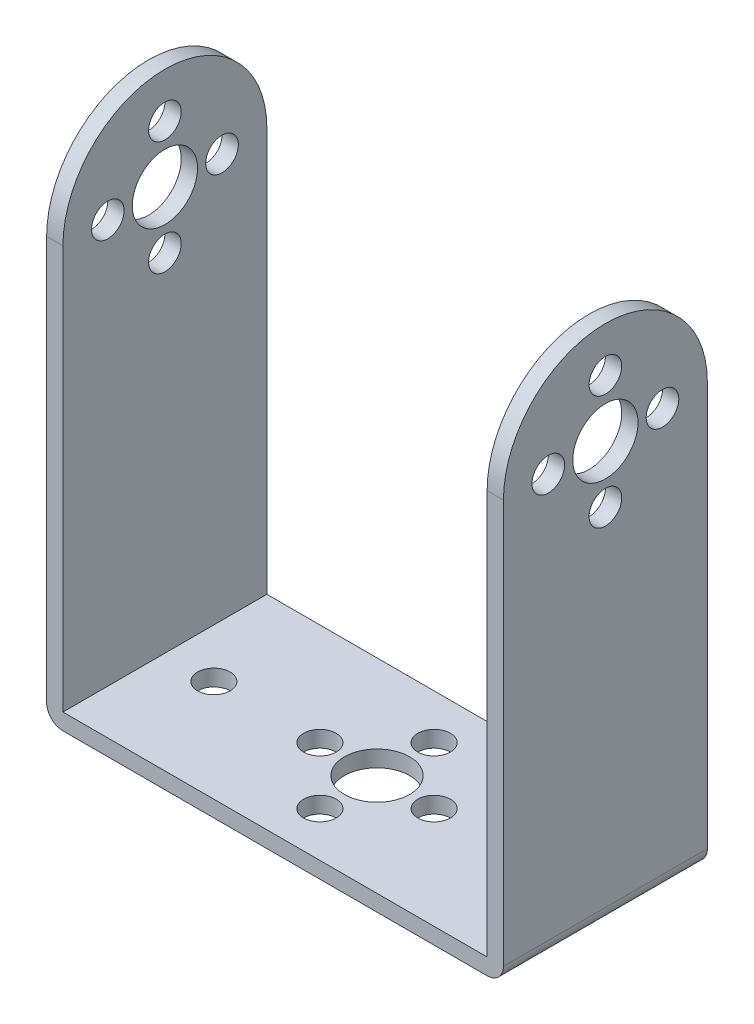
ISO-10303-21;
HEADER;
FILE_DESCRIPTION(('STEP AP214'),'2;1');
FILE_NAME('part.step','',(''),(''),'','','');
FILE_SCHEMA(('AUTOMOTIVE_DESIGN { 1 0 10303 214 1 1 1 1 }'));
ENDSEC;
DATA;
#1=APPLICATION_CONTEXT('core data for automotive mechanical design processes');
#2=APPLICATION_PROTOCOL_DEFINITION('international standard','automotive_design',2000,#1);
#3=PRODUCT_CONTEXT('',#1,'mechanical');
#4=PRODUCT('Part','Part','',(#3));
#5=PRODUCT_RELATED_PRODUCT_CATEGORY('part','',(#4));
#6=PRODUCT_DEFINITION_FORMATION('','',#4);
#7=PRODUCT_DEFINITION_CONTEXT('part definition',#1,'design');
#8=PRODUCT_DEFINITION('design','',#6,#7);
#9=PRODUCT_DEFINITION_SHAPE('','',#8);
#10=(LENGTH_UNIT() NAMED_UNIT(*) SI_UNIT(.MILLI.,.METRE.));
#11=(NAMED_UNIT(*) PLANE_ANGLE_UNIT() SI_UNIT($,.RADIAN.));
#12=(NAMED_UNIT(*) SI_UNIT($,.STERADIAN.) SOLID_ANGLE_UNIT());
#13=UNCERTAINTY_MEASURE_WITH_UNIT(LENGTH_MEASURE(1.E-05),#10,'distance_accuracy_value','');
#14=(GEOMETRIC_REPRESENTATION_CONTEXT(3) GLOBAL_UNCERTAINTY_ASSIGNED_CONTEXT((#13)) GLOBAL_UNIT_ASSIGNED_CONTEXT((#10,
#11,#12)) REPRESENTATION_CONTEXT('',''));
#15=CARTESIAN_POINT('',(0.,0.,0.));
#16=DIRECTION('',(0.,0.,1.));
#17=DIRECTION('',(1.,0.,0.));
#18=AXIS2_PLACEMENT_3D('',#15,#16,#17);
#19=CARTESIAN_POINT('',(2.,-23.75,10.7495807989479));
#20=DIRECTION('',(0.,0.,1.));
#21=DIRECTION('',(1.,0.,0.));
#22=AXIS2_PLACEMENT_3D('',#19,#20,#21);
#23=CYLINDRICAL_SURFACE('',#22,2.);
#24=DIRECTION('',(0.,0.,1.));
#25=VECTOR('',#24,1.);
#26=CARTESIAN_POINT('',(0.,-23.75,10.7495807989479));
#27=LINE('',#26,#25);
#28=CARTESIAN_POINT('',(0.,-23.75,-1.75041920105211));
#29=VERTEX_POINT('',#28);
#30=CARTESIAN_POINT('',(0.,-23.75,23.2495807989479));
#31=VERTEX_POINT('',#30);
#32=EDGE_CURVE('E169',#29,#31,#27,.T.);
#33=ORIENTED_EDGE('',*,*,#32,.F.);
#34=CARTESIAN_POINT('',(2.,-23.75,-1.75041920105211));
#35=DIRECTION('',(0.,0.,1.));
#36=DIRECTION('',(1.,0.,0.));
#37=AXIS2_PLACEMENT_3D('',#34,#35,#36);
#38=CIRCLE('',#37,2.);
#39=CARTESIAN_POINT('',(1.99999999999999,-25.75,-1.75041920105211));
#40=VERTEX_POINT('',#39);
#41=EDGE_CURVE('E46',#40,#29,#38,.F.);
#42=ORIENTED_EDGE('',*,*,#41,.F.);
#43=DIRECTION('',(0.,0.,1.));
#44=VECTOR('',#43,1.);
#45=CARTESIAN_POINT('',(2.,-25.75,23.2495807989479));
#46=LINE('',#45,#44);
#47=CARTESIAN_POINT('',(1.99999999999999,-25.75,23.2495807989479));
#48=VERTEX_POINT('',#47);
#49=EDGE_CURVE('E173',#48,#40,#46,.F.);
#50=ORIENTED_EDGE('',*,*,#49,.F.);
#51=CARTESIAN_POINT('',(2.,-23.75,23.2495807989479));
#52=DIRECTION('',(0.,0.,-1.));
#53=DIRECTION('',(0.,1.,0.));
#54=AXIS2_PLACEMENT_3D('',#51,#52,#53);
#55=CIRCLE('',#54,2.);
#56=EDGE_CURVE('E11',#31,#48,#55,.F.);
#57=ORIENTED_EDGE('',*,*,#56,.F.);
#58=EDGE_LOOP('',(#33,#42,#50,#57));
#59=FACE_BOUND('',#58,.T.);
#60=ADVANCED_FACE('F38',(#59),#23,.T.);
#61=CARTESIAN_POINT('',(54.,-23.75,10.7495807989479));
#62=DIRECTION('',(0.,0.,1.));
#63=DIRECTION('',(1.,0.,0.));
#64=AXIS2_PLACEMENT_3D('',#61,#62,#63);
#65=CYLINDRICAL_SURFACE('',#64,2.);
#66=DIRECTION('',(0.,0.,-1.));
#67=VECTOR('',#66,1.);
#68=CARTESIAN_POINT('',(56.,-23.75,10.7495807989479));
#69=LINE('',#68,#67);
#70=CARTESIAN_POINT('',(56.,-23.75,23.2495807989479));
#71=VERTEX_POINT('',#70);
#72=CARTESIAN_POINT('',(56.,-23.75,-1.75041920105211));
#73=VERTEX_POINT('',#72);
#74=EDGE_CURVE('E155',#71,#73,#69,.T.);
#75=ORIENTED_EDGE('',*,*,#74,.F.);
#76=CARTESIAN_POINT('',(54.,-23.75,23.2495807989479));
#77=DIRECTION('',(0.,0.,-1.));
#78=DIRECTION('',(0.,1.,0.));
#79=AXIS2_PLACEMENT_3D('',#76,#77,#78);
#80=CIRCLE('',#79,2.);
#81=CARTESIAN_POINT('',(54.,-25.75,23.2495807989479));
#82=VERTEX_POINT('',#81);
#83=EDGE_CURVE('E163',#82,#71,#80,.F.);
#84=ORIENTED_EDGE('',*,*,#83,.F.);
#85=DIRECTION('',(0.,0.,-1.));
#86=VECTOR('',#85,1.);
#87=CARTESIAN_POINT('',(54.,-25.75,10.7495807989479));
#88=LINE('',#87,#86);
#89=CARTESIAN_POINT('',(54.,-25.75,-1.75041920105211));
#90=VERTEX_POINT('',#89);
#91=EDGE_CURVE('E159',#90,#82,#88,.F.);
#92=ORIENTED_EDGE('',*,*,#91,.F.);
#93=CARTESIAN_POINT('',(54.,-23.75,-1.75041920105211));
#94=DIRECTION('',(0.,0.,1.));
#95=DIRECTION('',(1.,0.,0.));
#96=AXIS2_PLACEMENT_3D('',#93,#94,#95);
#97=CIRCLE('',#96,2.);
#98=EDGE_CURVE('E166',#73,#90,#97,.F.);
#99=ORIENTED_EDGE('',*,*,#98,.F.);
#100=EDGE_LOOP('',(#75,#84,#92,#99));
#101=FACE_BOUND('',#100,.T.);
#102=ADVANCED_FACE('F405',(#101),#65,.T.);
#103=CARTESIAN_POINT('',(56.,25.7500009851858,10.7495807989479));
#104=DIRECTION('',(-1.,0.,0.));
#105=DIRECTION('',(0.,0.,1.));
#106=AXIS2_PLACEMENT_3D('',#103,#104,#105);
#107=CYLINDRICAL_SURFACE('',#106,12.5);
#108=DIRECTION('',(-1.,0.,0.));
#109=VECTOR('',#108,1.);
#110=CARTESIAN_POINT('',(56.,25.7500009851858,23.2495807989479));
#111=LINE('',#110,#109);
#112=CARTESIAN_POINT('',(1.99999999999999,25.7500009851858,23.2495807989479));
#113=VERTEX_POINT('',#112);
#114=CARTESIAN_POINT('',(0.,25.7500009851858,23.2495807989479));
#115=VERTEX_POINT('',#114);
#116=EDGE_CURVE('E144',#113,#115,#111,.T.);
#117=ORIENTED_EDGE('',*,*,#116,.F.);
#118=CARTESIAN_POINT('',(2.,25.7500009851858,10.7495807989479));
#119=DIRECTION('',(-1.,0.,0.));
#120=DIRECTION('',(0.,-1.,0.));
#121=AXIS2_PLACEMENT_3D('',#118,#119,#120);
#122=CIRCLE('',#121,12.5);
#123=CARTESIAN_POINT('',(1.99999999999999,25.75,-1.75041920105209));
#124=VERTEX_POINT('',#123);
#125=EDGE_CURVE('E136',#124,#113,#122,.F.);
#126=ORIENTED_EDGE('',*,*,#125,.F.);
#127=DIRECTION('',(-1.,0.,0.));
#128=VECTOR('',#127,1.);
#129=CARTESIAN_POINT('',(56.,25.75,-1.75041920105209));
#130=LINE('',#129,#128);
#131=CARTESIAN_POINT('',(0.,25.75,-1.75041920105209));
#132=VERTEX_POINT('',#131);
#133=EDGE_CURVE('E143',#124,#132,#130,.T.);
#134=ORIENTED_EDGE('',*,*,#133,.T.);
#135=CARTESIAN_POINT('',(0.,25.7500009851858,10.7495807989479));
#136=DIRECTION('',(1.,0.,0.));
#137=DIRECTION('',(0.,0.,-1.));
#138=AXIS2_PLACEMENT_3D('',#135,#136,#137);
#139=CIRCLE('',#138,12.5);
#140=EDGE_CURVE('E190',#132,#115,#139,.T.);
#141=ORIENTED_EDGE('',*,*,#140,.T.);
#142=EDGE_LOOP('',(#117,#126,#134,#141));
#143=FACE_BOUND('',#142,.T.);
#144=ADVANCED_FACE('F387',(#143),#107,.T.);
#145=CARTESIAN_POINT('',(56.,25.7500009851858,10.7495807989479));
#146=DIRECTION('',(-1.,0.,0.));
#147=DIRECTION('',(0.,0.,1.));
#148=AXIS2_PLACEMENT_3D('',#145,#146,#147);
#149=CYLINDRICAL_SURFACE('',#148,4.);
#150=CARTESIAN_POINT('',(2.,25.7500009851858,10.7495807989479));
#151=DIRECTION('',(-1.,0.,0.));
#152=DIRECTION('',(0.,-1.,0.));
#153=AXIS2_PLACEMENT_3D('',#150,#151,#152);
#154=CIRCLE('',#153,4.);
#155=CARTESIAN_POINT('',(2.,21.7500009851858,10.7495807989479));
#156=VERTEX_POINT('',#155);
#157=EDGE_CURVE('E254',#156,#156,#154,.F.);
#158=ORIENTED_EDGE('',*,*,#157,.T.);
#159=EDGE_LOOP('',(#158));
#160=FACE_BOUND('',#159,.T.);
#161=CARTESIAN_POINT('',(0.,25.7500009851858,10.7495807989479));
#162=DIRECTION('',(1.,0.,0.));
#163=DIRECTION('',(0.,0.,-1.));
#164=AXIS2_PLACEMENT_3D('',#161,#162,#163);
#165=CIRCLE('',#164,4.);
#166=CARTESIAN_POINT('',(0.,25.7500009851858,6.7495807989479));
#167=VERTEX_POINT('',#166);
#168=EDGE_CURVE('E199',#167,#167,#165,.T.);
#169=ORIENTED_EDGE('',*,*,#168,.F.);
#170=EDGE_LOOP('',(#169));
#171=FACE_BOUND('',#170,.T.);
#172=ADVANCED_FACE('F413',(#160,#171),#149,.F.);
#173=CARTESIAN_POINT('',(56.,32.7500009851858,10.7495807989479));
#174=DIRECTION('',(-1.,0.,0.));
#175=DIRECTION('',(0.,0.,1.));
#176=AXIS2_PLACEMENT_3D('',#173,#174,#175);
#177=CYLINDRICAL_SURFACE('',#176,2.);
#178=CARTESIAN_POINT('',(2.,32.7500009851858,10.7495807989479));
#179=DIRECTION('',(-1.,0.,0.));
#180=DIRECTION('',(0.,-1.,0.));
#181=AXIS2_PLACEMENT_3D('',#178,#179,#180);
#182=CIRCLE('',#181,2.);
#183=CARTESIAN_POINT('',(2.,30.7500009851858,10.7495807989479));
#184=VERTEX_POINT('',#183);
#185=EDGE_CURVE('E255',#184,#184,#182,.F.);
#186=ORIENTED_EDGE('',*,*,#185,.T.);
#187=EDGE_LOOP('',(#186));
#188=FACE_BOUND('',#187,.T.);
#189=CARTESIAN_POINT('',(0.,32.7500009851858,10.7495807989479));
#190=DIRECTION('',(1.,0.,0.));
#191=DIRECTION('',(0.,0.,-1.));
#192=AXIS2_PLACEMENT_3D('',#189,#190,#191);
#193=CIRCLE('',#192,2.);
#194=CARTESIAN_POINT('',(0.,32.7500009851858,8.74958079894788));
#195=VERTEX_POINT('',#194);
#196=EDGE_CURVE('E220',#195,#195,#193,.T.);
#197=ORIENTED_EDGE('',*,*,#196,.F.);
#198=EDGE_LOOP('',(#197));
#199=FACE_BOUND('',#198,.T.);
#200=ADVANCED_FACE('F441',(#188,#199),#177,.F.);
#201=CARTESIAN_POINT('',(56.,25.7500019703715,17.749579813762));
#202=DIRECTION('',(-1.,0.,0.));
#203=DIRECTION('',(0.,0.,1.));
#204=AXIS2_PLACEMENT_3D('',#201,#202,#203);
#205=CYLINDRICAL_SURFACE('',#204,2.);
#206=CARTESIAN_POINT('',(2.,25.7500019703715,17.749579813762));
#207=DIRECTION('',(-1.,0.,0.));
#208=DIRECTION('',(0.,-1.,0.));
#209=AXIS2_PLACEMENT_3D('',#206,#207,#208);
#210=CIRCLE('',#209,2.);
#211=CARTESIAN_POINT('',(2.,23.7500019703715,17.749579813762));
#212=VERTEX_POINT('',#211);
#213=EDGE_CURVE('E260',#212,#212,#210,.F.);
#214=ORIENTED_EDGE('',*,*,#213,.T.);
#215=EDGE_LOOP('',(#214));
#216=FACE_BOUND('',#215,.T.);
#217=CARTESIAN_POINT('',(0.,25.7500019703715,17.749579813762));
#218=DIRECTION('',(1.,0.,0.));
#219=DIRECTION('',(0.,0.,-1.));
#220=AXIS2_PLACEMENT_3D('',#217,#218,#219);
#221=CIRCLE('',#220,2.);
#222=CARTESIAN_POINT('',(0.,25.7500019703715,15.749579813762));
#223=VERTEX_POINT('',#222);
#224=EDGE_CURVE('E228',#223,#223,#221,.T.);
#225=ORIENTED_EDGE('',*,*,#224,.F.);
#226=EDGE_LOOP('',(#225));
#227=FACE_BOUND('',#226,.T.);
#228=ADVANCED_FACE('F445',(#216,#227),#205,.F.);
#229=CARTESIAN_POINT('',(56.,18.7500029555574,10.7495807989477));
#230=DIRECTION('',(-1.,0.,0.));
#231=DIRECTION('',(0.,0.,1.));
#232=AXIS2_PLACEMENT_3D('',#229,#230,#231);
#233=CYLINDRICAL_SURFACE('',#232,2.);
#234=CARTESIAN_POINT('',(2.,18.7500029555574,10.7495807989477));
#235=DIRECTION('',(-1.,0.,0.));
#236=DIRECTION('',(0.,-1.,0.));
#237=AXIS2_PLACEMENT_3D('',#234,#235,#236);
#238=CIRCLE('',#237,2.);
#239=CARTESIAN_POINT('',(2.,16.7500029555574,10.7495807989477));
#240=VERTEX_POINT('',#239);
#241=EDGE_CURVE('E265',#240,#240,#238,.F.);
#242=ORIENTED_EDGE('',*,*,#241,.T.);
#243=EDGE_LOOP('',(#242));
#244=FACE_BOUND('',#243,.T.);
#245=CARTESIAN_POINT('',(0.,18.7500029555574,10.7495807989477));
#246=DIRECTION('',(1.,0.,0.));
#247=DIRECTION('',(0.,0.,-1.));
#248=AXIS2_PLACEMENT_3D('',#245,#246,#247);
#249=CIRCLE('',#248,2.);
#250=CARTESIAN_POINT('',(0.,18.7500029555574,8.74958079894772));
#251=VERTEX_POINT('',#250);
#252=EDGE_CURVE('E236',#251,#251,#249,.T.);
#253=ORIENTED_EDGE('',*,*,#252,.F.);
#254=EDGE_LOOP('',(#253));
#255=FACE_BOUND('',#254,.T.);
#256=ADVANCED_FACE('F448',(#244,#255),#233,.F.);
#257=CARTESIAN_POINT('',(56.,25.7500019703717,3.74958178413361));
#258=DIRECTION('',(-1.,0.,0.));
#259=DIRECTION('',(0.,0.,1.));
#260=AXIS2_PLACEMENT_3D('',#257,#258,#259);
#261=CYLINDRICAL_SURFACE('',#260,2.);
#262=CARTESIAN_POINT('',(2.,25.7500019703717,3.74958178413361));
#263=DIRECTION('',(-1.,0.,0.));
#264=DIRECTION('',(0.,-1.,0.));
#265=AXIS2_PLACEMENT_3D('',#262,#263,#264);
#266=CIRCLE('',#265,2.);
#267=CARTESIAN_POINT('',(2.,23.7500019703717,3.74958178413361));
#268=VERTEX_POINT('',#267);
#269=EDGE_CURVE('E270',#268,#268,#266,.F.);
#270=ORIENTED_EDGE('',*,*,#269,.T.);
#271=EDGE_LOOP('',(#270));
#272=FACE_BOUND('',#271,.T.);
#273=CARTESIAN_POINT('',(0.,25.7500019703717,3.74958178413361));
#274=DIRECTION('',(1.,0.,0.));
#275=DIRECTION('',(0.,0.,-1.));
#276=AXIS2_PLACEMENT_3D('',#273,#274,#275);
#277=CIRCLE('',#276,2.);
#278=CARTESIAN_POINT('',(0.,25.7500019703717,1.74958178413361));
#279=VERTEX_POINT('',#278);
#280=EDGE_CURVE('E123',#279,#279,#277,.T.);
#281=ORIENTED_EDGE('',*,*,#280,.F.);
#282=EDGE_LOOP('',(#281));
#283=FACE_BOUND('',#282,.T.);
#284=ADVANCED_FACE('F400',(#272,#283),#261,.F.);
#285=CARTESIAN_POINT('',(56.,25.7500009851858,10.7495807989479));
#286=DIRECTION('',(1.,0.,0.));
#287=DIRECTION('',(0.,0.,-1.));
#288=AXIS2_PLACEMENT_3D('',#285,#286,#287);
#289=PLANE('',#288);
#290=CARTESIAN_POINT('',(56.,18.7500029555574,10.7495807989477));
#291=DIRECTION('',(1.,0.,0.));
#292=DIRECTION('',(0.,0.,-1.));
#293=AXIS2_PLACEMENT_3D('',#290,#291,#292);
#294=CIRCLE('',#293,2.);
#295=CARTESIAN_POINT('',(56.,18.7500029555574,8.74958079894772));
#296=VERTEX_POINT('',#295);
#297=EDGE_CURVE('E232',#296,#296,#294,.T.);
#298=ORIENTED_EDGE('',*,*,#297,.F.);
#299=EDGE_LOOP('',(#298));
#300=FACE_BOUND('',#299,.T.);
#301=CARTESIAN_POINT('',(56.,32.7500009851858,10.7495807989479));
#302=DIRECTION('',(1.,0.,0.));
#303=DIRECTION('',(0.,0.,-1.));
#304=AXIS2_PLACEMENT_3D('',#301,#302,#303);
#305=CIRCLE('',#304,2.);
#306=CARTESIAN_POINT('',(56.,32.7500009851858,8.74958079894788));
#307=VERTEX_POINT('',#306);
#308=EDGE_CURVE('E218',#307,#307,#305,.T.);
#309=ORIENTED_EDGE('',*,*,#308,.F.);
#310=EDGE_LOOP('',(#309));
#311=FACE_BOUND('',#310,.T.);
#312=DIRECTION('',(0.,-1.,0.));
#313=VECTOR('',#312,1.);
#314=CARTESIAN_POINT('',(56.,25.7500009851858,23.2495807989479));
#315=LINE('',#314,#313);
#316=CARTESIAN_POINT('',(56.,25.7500009851858,23.2495807989479));
#317=VERTEX_POINT('',#316);
#318=EDGE_CURVE('E141',#317,#71,#315,.T.);
#319=ORIENTED_EDGE('',*,*,#318,.T.);
#320=ORIENTED_EDGE('',*,*,#74,.T.);
#321=DIRECTION('',(0.,1.,0.));
#322=VECTOR('',#321,1.);
#323=CARTESIAN_POINT('',(56.,25.75,-1.75041920105211));
#324=LINE('',#323,#322);
#325=CARTESIAN_POINT('',(56.,25.75,-1.75041920105209));
#326=VERTEX_POINT('',#325);
#327=EDGE_CURVE('E205',#73,#326,#324,.T.);
#328=ORIENTED_EDGE('',*,*,#327,.T.);
#329=CARTESIAN_POINT('',(56.,25.7500009851858,10.7495807989479));
#330=DIRECTION('',(1.,0.,0.));
#331=DIRECTION('',(0.,0.,-1.));
#332=AXIS2_PLACEMENT_3D('',#329,#330,#331);
#333=CIRCLE('',#332,12.5);
#334=EDGE_CURVE('E210',#326,#317,#333,.T.);
#335=ORIENTED_EDGE('',*,*,#334,.T.);
#336=EDGE_LOOP('',(#319,#320,#328,#335));
#337=FACE_BOUND('',#336,.T.);
#338=CARTESIAN_POINT('',(56.,25.7500009851858,10.7495807989479));
#339=DIRECTION('',(1.,0.,0.));
#340=DIRECTION('',(0.,0.,-1.));
#341=AXIS2_PLACEMENT_3D('',#338,#339,#340);
#342=CIRCLE('',#341,4.);
#343=CARTESIAN_POINT('',(56.,25.7500009851858,6.7495807989479));
#344=VERTEX_POINT('',#343);
#345=EDGE_CURVE('E192',#344,#344,#342,.T.);
#346=ORIENTED_EDGE('',*,*,#345,.F.);
#347=EDGE_LOOP('',(#346));
#348=FACE_BOUND('',#347,.T.);
#349=CARTESIAN_POINT('',(56.,25.7500019703715,17.749579813762));
#350=DIRECTION('',(1.,0.,0.));
#351=DIRECTION('',(0.,0.,-1.));
#352=AXIS2_PLACEMENT_3D('',#349,#350,#351);
#353=CIRCLE('',#352,2.);
#354=CARTESIAN_POINT('',(56.,25.7500019703715,15.749579813762));
#355=VERTEX_POINT('',#354);
#356=EDGE_CURVE('E224',#355,#355,#353,.T.);
#357=ORIENTED_EDGE('',*,*,#356,.F.);
#358=EDGE_LOOP('',(#357));
#359=FACE_BOUND('',#358,.T.);
#360=CARTESIAN_POINT('',(56.,25.7500019703717,3.74958178413361));
#361=DIRECTION('',(1.,0.,0.));
#362=DIRECTION('',(0.,0.,-1.));
#363=AXIS2_PLACEMENT_3D('',#360,#361,#362);
#364=CIRCLE('',#363,2.);
#365=CARTESIAN_POINT('',(56.,25.7500019703717,1.74958178413361));
#366=VERTEX_POINT('',#365);
#367=EDGE_CURVE('E240',#366,#366,#364,.T.);
#368=ORIENTED_EDGE('',*,*,#367,.F.);
#369=EDGE_LOOP('',(#368));
#370=FACE_BOUND('',#369,.T.);
#371=ADVANCED_FACE('F429',(#300,#311,#337,#348,#359,#370),#289,.T.);
#372=CARTESIAN_POINT('',(0.,25.7500009851858,10.7495807989479));
#373=DIRECTION('',(1.,0.,0.));
#374=DIRECTION('',(0.,0.,-1.));
#375=AXIS2_PLACEMENT_3D('',#372,#373,#374);
#376=PLANE('',#375);
#377=DIRECTION('',(0.,1.,0.));
#378=VECTOR('',#377,1.);
#379=CARTESIAN_POINT('',(0.,25.75,-1.75041920105211));
#380=LINE('',#379,#378);
#381=EDGE_CURVE('E181',#29,#132,#380,.T.);
#382=ORIENTED_EDGE('',*,*,#381,.F.);
#383=ORIENTED_EDGE('',*,*,#32,.T.);
#384=DIRECTION('',(0.,-1.,0.));
#385=VECTOR('',#384,1.);
#386=CARTESIAN_POINT('',(0.,25.7500009851858,23.2495807989479));
#387=LINE('',#386,#385);
#388=EDGE_CURVE('E196',#115,#31,#387,.T.);
#389=ORIENTED_EDGE('',*,*,#388,.F.);
#390=ORIENTED_EDGE('',*,*,#140,.F.);
#391=EDGE_LOOP('',(#382,#383,#389,#390));
#392=FACE_BOUND('',#391,.T.);
#393=ORIENTED_EDGE('',*,*,#168,.T.);
#394=EDGE_LOOP('',(#393));
#395=FACE_BOUND('',#394,.T.);
#396=ORIENTED_EDGE('',*,*,#196,.T.);
#397=EDGE_LOOP('',(#396));
#398=FACE_BOUND('',#397,.T.);
#399=ORIENTED_EDGE('',*,*,#224,.T.);
#400=EDGE_LOOP('',(#399));
#401=FACE_BOUND('',#400,.T.);
#402=ORIENTED_EDGE('',*,*,#252,.T.);
#403=EDGE_LOOP('',(#402));
#404=FACE_BOUND('',#403,.T.);
#405=ORIENTED_EDGE('',*,*,#280,.T.);
#406=EDGE_LOOP('',(#405));
#407=FACE_BOUND('',#406,.T.);
#408=ADVANCED_FACE('F187',(#392,#395,#398,#401,#404,#407),#376,.F.);
#409=CARTESIAN_POINT('',(56.,25.75,-1.75041920105211));
#410=DIRECTION('',(0.,0.,1.));
#411=DIRECTION('',(1.,0.,0.));
#412=AXIS2_PLACEMENT_3D('',#409,#410,#411);
#413=PLANE('',#412);
#414=DIRECTION('',(-1.,0.,0.));
#415=VECTOR('',#414,1.);
#416=CARTESIAN_POINT('',(56.,-25.75,-1.75041920105211));
#417=LINE('',#416,#415);
#418=EDGE_CURVE('E183',#90,#40,#417,.T.);
#419=ORIENTED_EDGE('',*,*,#418,.T.);
#420=ORIENTED_EDGE('',*,*,#41,.T.);
#421=ORIENTED_EDGE('',*,*,#381,.T.);
#422=ORIENTED_EDGE('',*,*,#133,.F.);
#423=DIRECTION('',(0.,1.,0.));
#424=VECTOR('',#423,1.);
#425=CARTESIAN_POINT('',(2.,40.25,-1.7504192010521));
#426=LINE('',#425,#424);
#427=CARTESIAN_POINT('',(1.99999999999999,-23.75,-1.75041920105211));
#428=VERTEX_POINT('',#427);
#429=EDGE_CURVE('E286',#428,#124,#426,.T.);
#430=ORIENTED_EDGE('',*,*,#429,.F.);
#431=DIRECTION('',(-1.,0.,0.));
#432=VECTOR('',#431,1.);
#433=CARTESIAN_POINT('',(54.,-23.75,-1.75041920105211));
#434=LINE('',#433,#432);
#435=CARTESIAN_POINT('',(54.,-23.75,-1.75041920105211));
#436=VERTEX_POINT('',#435);
#437=EDGE_CURVE('E277',#436,#428,#434,.T.);
#438=ORIENTED_EDGE('',*,*,#437,.F.);
#439=DIRECTION('',(0.,-1.,0.));
#440=VECTOR('',#439,1.);
#441=CARTESIAN_POINT('',(54.,40.25,-1.7504192010521));
#442=LINE('',#441,#440);
#443=CARTESIAN_POINT('',(54.,25.7500009851858,-1.7504192010521));
#444=VERTEX_POINT('',#443);
#445=EDGE_CURVE('E283',#444,#436,#442,.T.);
#446=ORIENTED_EDGE('',*,*,#445,.F.);
#447=EDGE_CURVE('E134',#326,#444,#130,.T.);
#448=ORIENTED_EDGE('',*,*,#447,.F.);
#449=ORIENTED_EDGE('',*,*,#327,.F.);
#450=ORIENTED_EDGE('',*,*,#98,.T.);
#451=EDGE_LOOP('',(#419,#420,#421,#422,#430,#438,#446,#448,#449,#450));
#452=FACE_BOUND('',#451,.T.);
#453=ADVANCED_FACE('F178',(#452),#413,.F.);
#454=ORIENTED_EDGE('',*,*,#447,.T.);
#455=CARTESIAN_POINT('',(54.,25.7500009851858,10.7495807989479));
#456=DIRECTION('',(1.,0.,0.));
#457=DIRECTION('',(0.,1.,0.));
#458=AXIS2_PLACEMENT_3D('',#455,#456,#457);
#459=CIRCLE('',#458,12.5);
#460=CARTESIAN_POINT('',(54.,25.7500009851858,23.2495807989479));
#461=VERTEX_POINT('',#460);
#462=EDGE_CURVE('E116',#461,#444,#459,.F.);
#463=ORIENTED_EDGE('',*,*,#462,.F.);
#464=EDGE_CURVE('E131',#317,#461,#111,.T.);
#465=ORIENTED_EDGE('',*,*,#464,.F.);
#466=ORIENTED_EDGE('',*,*,#334,.F.);
#467=EDGE_LOOP('',(#454,#463,#465,#466));
#468=FACE_BOUND('',#467,.T.);
#469=ADVANCED_FACE('F129',(#468),#107,.T.);
#470=CARTESIAN_POINT('',(56.,25.7500009851858,23.2495807989479));
#471=DIRECTION('',(0.,0.,-1.));
#472=DIRECTION('',(0.,1.,0.));
#473=AXIS2_PLACEMENT_3D('',#470,#471,#472);
#474=PLANE('',#473);
#475=ORIENTED_EDGE('',*,*,#388,.T.);
#476=ORIENTED_EDGE('',*,*,#56,.T.);
#477=DIRECTION('',(-1.,0.,0.));
#478=VECTOR('',#477,1.);
#479=CARTESIAN_POINT('',(56.,-25.75,23.2495807989479));
#480=LINE('',#479,#478);
#481=EDGE_CURVE('E150',#82,#48,#480,.T.);
#482=ORIENTED_EDGE('',*,*,#481,.F.);
#483=ORIENTED_EDGE('',*,*,#83,.T.);
#484=ORIENTED_EDGE('',*,*,#318,.F.);
#485=ORIENTED_EDGE('',*,*,#464,.T.);
#486=DIRECTION('',(0.,1.,0.));
#487=VECTOR('',#486,1.);
#488=CARTESIAN_POINT('',(54.,40.25,23.2495807989479));
#489=LINE('',#488,#487);
#490=CARTESIAN_POINT('',(54.,-23.75,23.2495807989479));
#491=VERTEX_POINT('',#490);
#492=EDGE_CURVE('E112',#491,#461,#489,.T.);
#493=ORIENTED_EDGE('',*,*,#492,.F.);
#494=DIRECTION('',(1.,0.,0.));
#495=VECTOR('',#494,1.);
#496=CARTESIAN_POINT('',(54.,-23.75,23.2495807989479));
#497=LINE('',#496,#495);
#498=CARTESIAN_POINT('',(1.99999999999999,-23.75,23.2495807989479));
#499=VERTEX_POINT('',#498);
#500=EDGE_CURVE('E292',#499,#491,#497,.T.);
#501=ORIENTED_EDGE('',*,*,#500,.F.);
#502=DIRECTION('',(0.,-1.,0.));
#503=VECTOR('',#502,1.);
#504=CARTESIAN_POINT('',(2.,40.25,23.2495807989479));
#505=LINE('',#504,#503);
#506=EDGE_CURVE('E289',#113,#499,#505,.T.);
#507=ORIENTED_EDGE('',*,*,#506,.F.);
#508=ORIENTED_EDGE('',*,*,#116,.T.);
#509=EDGE_LOOP('',(#475,#476,#482,#483,#484,#485,#493,#501,#507,#508));
#510=FACE_BOUND('',#509,.T.);
#511=ADVANCED_FACE('F139',(#510),#474,.F.);
#512=CARTESIAN_POINT('',(56.,-25.75,23.2495807989479));
#513=DIRECTION('',(0.,1.,0.));
#514=DIRECTION('',(0.,0.,1.));
#515=AXIS2_PLACEMENT_3D('',#512,#513,#514);
#516=PLANE('',#515);
#517=CARTESIAN_POINT('',(21.,-25.75,10.7495807989478));
#518=DIRECTION('',(0.,1.,0.));
#519=DIRECTION('',(0.,0.,1.));
#520=AXIS2_PLACEMENT_3D('',#517,#518,#519);
#521=CIRCLE('',#520,2.00000000000001);
#522=CARTESIAN_POINT('',(21.,-25.75,12.7495807989478));
#523=VERTEX_POINT('',#522);
#524=EDGE_CURVE('E336',#523,#523,#521,.F.);
#525=ORIENTED_EDGE('',*,*,#524,.F.);
#526=EDGE_LOOP('',(#525));
#527=FACE_BOUND('',#526,.T.);
#528=CARTESIAN_POINT('',(28.,-25.75,17.7495807989479));
#529=DIRECTION('',(0.,1.,0.));
#530=DIRECTION('',(0.,0.,1.));
#531=AXIS2_PLACEMENT_3D('',#528,#529,#530);
#532=CIRCLE('',#531,2.);
#533=CARTESIAN_POINT('',(28.,-25.75,19.7495807989479));
#534=VERTEX_POINT('',#533);
#535=EDGE_CURVE('E329',#534,#534,#532,.F.);
#536=ORIENTED_EDGE('',*,*,#535,.F.);
#537=EDGE_LOOP('',(#536));
#538=FACE_BOUND('',#537,.T.);
#539=CARTESIAN_POINT('',(7.99999999999999,-25.75,10.7495807989478));
#540=DIRECTION('',(0.,1.,0.));
#541=DIRECTION('',(0.,0.,1.));
#542=AXIS2_PLACEMENT_3D('',#539,#540,#541);
#543=CIRCLE('',#542,2.);
#544=CARTESIAN_POINT('',(7.99999999999999,-25.75,12.7495807989478));
#545=VERTEX_POINT('',#544);
#546=EDGE_CURVE('E320',#545,#545,#543,.F.);
#547=ORIENTED_EDGE('',*,*,#546,.F.);
#548=EDGE_LOOP('',(#547));
#549=FACE_BOUND('',#548,.T.);
#550=CARTESIAN_POINT('',(35.,-25.75,10.7495807989479));
#551=DIRECTION('',(0.,1.,0.));
#552=DIRECTION('',(0.,0.,1.));
#553=AXIS2_PLACEMENT_3D('',#550,#551,#552);
#554=CIRCLE('',#553,2.);
#555=CARTESIAN_POINT('',(35.,-25.75,12.7495807989479));
#556=VERTEX_POINT('',#555);
#557=EDGE_CURVE('E319',#556,#556,#554,.F.);
#558=ORIENTED_EDGE('',*,*,#557,.F.);
#559=EDGE_LOOP('',(#558));
#560=FACE_BOUND('',#559,.T.);
#561=CARTESIAN_POINT('',(28.0000000000001,-25.75,3.74958079894788));
#562=DIRECTION('',(0.,1.,0.));
#563=DIRECTION('',(0.,0.,1.));
#564=AXIS2_PLACEMENT_3D('',#561,#562,#563);
#565=CIRCLE('',#564,2.);
#566=CARTESIAN_POINT('',(28.0000000000001,-25.75,5.74958079894789));
#567=VERTEX_POINT('',#566);
#568=EDGE_CURVE('E345',#567,#567,#565,.F.);
#569=ORIENTED_EDGE('',*,*,#568,.F.);
#570=EDGE_LOOP('',(#569));
#571=FACE_BOUND('',#570,.T.);
#572=CARTESIAN_POINT('',(48.,-25.75,10.7495807989479));
#573=DIRECTION('',(0.,1.,0.));
#574=DIRECTION('',(0.,0.,1.));
#575=AXIS2_PLACEMENT_3D('',#572,#573,#574);
#576=CIRCLE('',#575,2.);
#577=CARTESIAN_POINT('',(48.,-25.75,12.7495807989479));
#578=VERTEX_POINT('',#577);
#579=EDGE_CURVE('E352',#578,#578,#576,.F.);
#580=ORIENTED_EDGE('',*,*,#579,.F.);
#581=EDGE_LOOP('',(#580));
#582=FACE_BOUND('',#581,.T.);
#583=CARTESIAN_POINT('',(28.,-25.75,10.7495807989479));
#584=DIRECTION('',(0.,1.,0.));
#585=DIRECTION('',(0.,0.,1.));
#586=AXIS2_PLACEMENT_3D('',#583,#584,#585);
#587=CIRCLE('',#586,4.00000000000001);
#588=CARTESIAN_POINT('',(28.,-25.75,14.7495807989479));
#589=VERTEX_POINT('',#588);
#590=EDGE_CURVE('E137',#589,#589,#587,.F.);
#591=ORIENTED_EDGE('',*,*,#590,.F.);
#592=EDGE_LOOP('',(#591));
#593=FACE_BOUND('',#592,.T.);
#594=ORIENTED_EDGE('',*,*,#481,.T.);
#595=ORIENTED_EDGE('',*,*,#49,.T.);
#596=ORIENTED_EDGE('',*,*,#418,.F.);
#597=ORIENTED_EDGE('',*,*,#91,.T.);
#598=EDGE_LOOP('',(#594,#595,#596,#597));
#599=FACE_BOUND('',#598,.T.);
#600=ADVANCED_FACE('F422',(#527,#538,#549,#560,#571,#582,#593,#599),#516,.F.);
#601=CARTESIAN_POINT('',(54.,25.7500009851858,10.7495807989479));
#602=DIRECTION('',(1.,0.,0.));
#603=DIRECTION('',(0.,1.,0.));
#604=AXIS2_PLACEMENT_3D('',#601,#602,#603);
#605=CIRCLE('',#604,4.);
#606=CARTESIAN_POINT('',(54.,29.7500009851858,10.7495807989479));
#607=VERTEX_POINT('',#606);
#608=EDGE_CURVE('E250',#607,#607,#605,.F.);
#609=ORIENTED_EDGE('',*,*,#608,.T.);
#610=EDGE_LOOP('',(#609));
#611=FACE_BOUND('',#610,.T.);
#612=ORIENTED_EDGE('',*,*,#345,.T.);
#613=EDGE_LOOP('',(#612));
#614=FACE_BOUND('',#613,.T.);
#615=ADVANCED_FACE('F425',(#611,#614),#149,.F.);
#616=CARTESIAN_POINT('',(54.,32.7500009851858,10.7495807989479));
#617=DIRECTION('',(1.,0.,0.));
#618=DIRECTION('',(0.,1.,0.));
#619=AXIS2_PLACEMENT_3D('',#616,#617,#618);
#620=CIRCLE('',#619,2.);
#621=CARTESIAN_POINT('',(54.,34.7500009851858,10.7495807989479));
#622=VERTEX_POINT('',#621);
#623=EDGE_CURVE('E256',#622,#622,#620,.F.);
#624=ORIENTED_EDGE('',*,*,#623,.T.);
#625=EDGE_LOOP('',(#624));
#626=FACE_BOUND('',#625,.T.);
#627=ORIENTED_EDGE('',*,*,#308,.T.);
#628=EDGE_LOOP('',(#627));
#629=FACE_BOUND('',#628,.T.);
#630=ADVANCED_FACE('F435',(#626,#629),#177,.F.);
#631=CARTESIAN_POINT('',(54.,25.7500019703715,17.749579813762));
#632=DIRECTION('',(1.,0.,0.));
#633=DIRECTION('',(0.,1.,0.));
#634=AXIS2_PLACEMENT_3D('',#631,#632,#633);
#635=CIRCLE('',#634,2.);
#636=CARTESIAN_POINT('',(54.,27.7500019703715,17.749579813762));
#637=VERTEX_POINT('',#636);
#638=EDGE_CURVE('E261',#637,#637,#635,.F.);
#639=ORIENTED_EDGE('',*,*,#638,.T.);
#640=EDGE_LOOP('',(#639));
#641=FACE_BOUND('',#640,.T.);
#642=ORIENTED_EDGE('',*,*,#356,.T.);
#643=EDGE_LOOP('',(#642));
#644=FACE_BOUND('',#643,.T.);
#645=ADVANCED_FACE('F439',(#641,#644),#205,.F.);
#646=CARTESIAN_POINT('',(54.,18.7500029555574,10.7495807989477));
#647=DIRECTION('',(1.,0.,0.));
#648=DIRECTION('',(0.,1.,0.));
#649=AXIS2_PLACEMENT_3D('',#646,#647,#648);
#650=CIRCLE('',#649,2.);
#651=CARTESIAN_POINT('',(54.,20.7500029555574,10.7495807989477));
#652=VERTEX_POINT('',#651);
#653=EDGE_CURVE('E266',#652,#652,#650,.F.);
#654=ORIENTED_EDGE('',*,*,#653,.T.);
#655=EDGE_LOOP('',(#654));
#656=FACE_BOUND('',#655,.T.);
#657=ORIENTED_EDGE('',*,*,#297,.T.);
#658=EDGE_LOOP('',(#657));
#659=FACE_BOUND('',#658,.T.);
#660=ADVANCED_FACE('F397',(#656,#659),#233,.F.);
#661=CARTESIAN_POINT('',(54.,25.7500019703717,3.74958178413361));
#662=DIRECTION('',(1.,0.,0.));
#663=DIRECTION('',(0.,1.,0.));
#664=AXIS2_PLACEMENT_3D('',#661,#662,#663);
#665=CIRCLE('',#664,2.);
#666=CARTESIAN_POINT('',(54.,27.7500019703717,3.74958178413361));
#667=VERTEX_POINT('',#666);
#668=EDGE_CURVE('E271',#667,#667,#665,.F.);
#669=ORIENTED_EDGE('',*,*,#668,.T.);
#670=EDGE_LOOP('',(#669));
#671=FACE_BOUND('',#670,.T.);
#672=ORIENTED_EDGE('',*,*,#367,.T.);
#673=EDGE_LOOP('',(#672));
#674=FACE_BOUND('',#673,.T.);
#675=ADVANCED_FACE('F391',(#671,#674),#261,.F.);
#676=CARTESIAN_POINT('',(2.,40.25,23.2505807989479));
#677=DIRECTION('',(-1.,0.,0.));
#678=DIRECTION('',(0.,-1.,0.));
#679=AXIS2_PLACEMENT_3D('',#676,#677,#678);
#680=PLANE('',#679);
#681=ORIENTED_EDGE('',*,*,#269,.F.);
#682=EDGE_LOOP('',(#681));
#683=FACE_BOUND('',#682,.T.);
#684=ORIENTED_EDGE('',*,*,#241,.F.);
#685=EDGE_LOOP('',(#684));
#686=FACE_BOUND('',#685,.T.);
#687=ORIENTED_EDGE('',*,*,#213,.F.);
#688=EDGE_LOOP('',(#687));
#689=FACE_BOUND('',#688,.T.);
#690=ORIENTED_EDGE('',*,*,#185,.F.);
#691=EDGE_LOOP('',(#690));
#692=FACE_BOUND('',#691,.T.);
#693=ORIENTED_EDGE('',*,*,#157,.F.);
#694=EDGE_LOOP('',(#693));
#695=FACE_BOUND('',#694,.T.);
#696=ORIENTED_EDGE('',*,*,#125,.T.);
#697=ORIENTED_EDGE('',*,*,#506,.T.);
#698=DIRECTION('',(0.,0.,-1.));
#699=VECTOR('',#698,1.);
#700=CARTESIAN_POINT('',(1.99999999999999,-23.75,23.2505807989479));
#701=LINE('',#700,#699);
#702=EDGE_CURVE('E124',#499,#428,#701,.T.);
#703=ORIENTED_EDGE('',*,*,#702,.T.);
#704=ORIENTED_EDGE('',*,*,#429,.T.);
#705=EDGE_LOOP('',(#696,#697,#703,#704));
#706=FACE_BOUND('',#705,.T.);
#707=ADVANCED_FACE('F374',(#683,#686,#689,#692,#695,#706),#680,.F.);
#708=CARTESIAN_POINT('',(54.,-23.75,23.2505807989479));
#709=DIRECTION('',(0.,-1.,0.));
#710=DIRECTION('',(0.,0.,-1.));
#711=AXIS2_PLACEMENT_3D('',#708,#709,#710);
#712=PLANE('',#711);
#713=CARTESIAN_POINT('',(21.,-23.75,10.7495807989478));
#714=DIRECTION('',(0.,1.,0.));
#715=DIRECTION('',(0.,0.,1.));
#716=AXIS2_PLACEMENT_3D('',#713,#714,#715);
#717=CIRCLE('',#716,2.00000000000001);
#718=CARTESIAN_POINT('',(21.,-23.75,12.7495807989478));
#719=VERTEX_POINT('',#718);
#720=EDGE_CURVE('E341',#719,#719,#717,.T.);
#721=ORIENTED_EDGE('',*,*,#720,.F.);
#722=EDGE_LOOP('',(#721));
#723=FACE_BOUND('',#722,.T.);
#724=CARTESIAN_POINT('',(28.,-23.75,17.7495807989479));
#725=DIRECTION('',(0.,1.,0.));
#726=DIRECTION('',(0.,0.,1.));
#727=AXIS2_PLACEMENT_3D('',#724,#725,#726);
#728=CIRCLE('',#727,2.);
#729=CARTESIAN_POINT('',(28.,-23.75,19.7495807989479));
#730=VERTEX_POINT('',#729);
#731=EDGE_CURVE('E340',#730,#730,#728,.T.);
#732=ORIENTED_EDGE('',*,*,#731,.F.);
#733=EDGE_LOOP('',(#732));
#734=FACE_BOUND('',#733,.T.);
#735=CARTESIAN_POINT('',(7.99999999999999,-23.75,10.7495807989478));
#736=DIRECTION('',(0.,1.,0.));
#737=DIRECTION('',(0.,0.,1.));
#738=AXIS2_PLACEMENT_3D('',#735,#736,#737);
#739=CIRCLE('',#738,2.);
#740=CARTESIAN_POINT('',(7.99999999999999,-23.75,12.7495807989478));
#741=VERTEX_POINT('',#740);
#742=EDGE_CURVE('E325',#741,#741,#739,.T.);
#743=ORIENTED_EDGE('',*,*,#742,.F.);
#744=EDGE_LOOP('',(#743));
#745=FACE_BOUND('',#744,.T.);
#746=CARTESIAN_POINT('',(35.,-23.75,10.7495807989479));
#747=DIRECTION('',(0.,1.,0.));
#748=DIRECTION('',(0.,0.,1.));
#749=AXIS2_PLACEMENT_3D('',#746,#747,#748);
#750=CIRCLE('',#749,2.);
#751=CARTESIAN_POINT('',(35.,-23.75,12.7495807989479));
#752=VERTEX_POINT('',#751);
#753=EDGE_CURVE('E324',#752,#752,#750,.T.);
#754=ORIENTED_EDGE('',*,*,#753,.F.);
#755=EDGE_LOOP('',(#754));
#756=FACE_BOUND('',#755,.T.);
#757=CARTESIAN_POINT('',(28.0000000000001,-23.75,3.74958079894788));
#758=DIRECTION('',(0.,1.,0.));
#759=DIRECTION('',(0.,0.,1.));
#760=AXIS2_PLACEMENT_3D('',#757,#758,#759);
#761=CIRCLE('',#760,2.);
#762=CARTESIAN_POINT('',(28.0000000000001,-23.75,5.74958079894789));
#763=VERTEX_POINT('',#762);
#764=EDGE_CURVE('E356',#763,#763,#761,.T.);
#765=ORIENTED_EDGE('',*,*,#764,.F.);
#766=EDGE_LOOP('',(#765));
#767=FACE_BOUND('',#766,.T.);
#768=CARTESIAN_POINT('',(48.,-23.75,10.7495807989479));
#769=DIRECTION('',(0.,1.,0.));
#770=DIRECTION('',(0.,0.,1.));
#771=AXIS2_PLACEMENT_3D('',#768,#769,#770);
#772=CIRCLE('',#771,2.);
#773=CARTESIAN_POINT('',(48.,-23.75,12.7495807989479));
#774=VERTEX_POINT('',#773);
#775=EDGE_CURVE('E357',#774,#774,#772,.T.);
#776=ORIENTED_EDGE('',*,*,#775,.F.);
#777=EDGE_LOOP('',(#776));
#778=FACE_BOUND('',#777,.T.);
#779=CARTESIAN_POINT('',(28.,-23.75,10.7495807989479));
#780=DIRECTION('',(0.,1.,0.));
#781=DIRECTION('',(0.,0.,1.));
#782=AXIS2_PLACEMENT_3D('',#779,#780,#781);
#783=CIRCLE('',#782,4.00000000000001);
#784=CARTESIAN_POINT('',(28.,-23.75,14.7495807989479));
#785=VERTEX_POINT('',#784);
#786=EDGE_CURVE('E315',#785,#785,#783,.T.);
#787=ORIENTED_EDGE('',*,*,#786,.F.);
#788=EDGE_LOOP('',(#787));
#789=FACE_BOUND('',#788,.T.);
#790=ORIENTED_EDGE('',*,*,#500,.T.);
#791=DIRECTION('',(0.,0.,-1.));
#792=VECTOR('',#791,1.);
#793=CARTESIAN_POINT('',(54.,-23.75,23.2505807989479));
#794=LINE('',#793,#792);
#795=EDGE_CURVE('E118',#491,#436,#794,.T.);
#796=ORIENTED_EDGE('',*,*,#795,.T.);
#797=ORIENTED_EDGE('',*,*,#437,.T.);
#798=ORIENTED_EDGE('',*,*,#702,.F.);
#799=EDGE_LOOP('',(#790,#796,#797,#798));
#800=FACE_BOUND('',#799,.T.);
#801=ADVANCED_FACE('F371',(#723,#734,#745,#756,#767,#778,#789,#800),#712,.F.);
#802=CARTESIAN_POINT('',(54.,40.25,23.2505807989479));
#803=DIRECTION('',(1.,0.,0.));
#804=DIRECTION('',(0.,1.,0.));
#805=AXIS2_PLACEMENT_3D('',#802,#803,#804);
#806=PLANE('',#805);
#807=ORIENTED_EDGE('',*,*,#668,.F.);
#808=EDGE_LOOP('',(#807));
#809=FACE_BOUND('',#808,.T.);
#810=ORIENTED_EDGE('',*,*,#653,.F.);
#811=EDGE_LOOP('',(#810));
#812=FACE_BOUND('',#811,.T.);
#813=ORIENTED_EDGE('',*,*,#638,.F.);
#814=EDGE_LOOP('',(#813));
#815=FACE_BOUND('',#814,.T.);
#816=ORIENTED_EDGE('',*,*,#623,.F.);
#817=EDGE_LOOP('',(#816));
#818=FACE_BOUND('',#817,.T.);
#819=ORIENTED_EDGE('',*,*,#608,.F.);
#820=EDGE_LOOP('',(#819));
#821=FACE_BOUND('',#820,.T.);
#822=ORIENTED_EDGE('',*,*,#462,.T.);
#823=ORIENTED_EDGE('',*,*,#445,.T.);
#824=ORIENTED_EDGE('',*,*,#795,.F.);
#825=ORIENTED_EDGE('',*,*,#492,.T.);
#826=EDGE_LOOP('',(#822,#823,#824,#825));
#827=FACE_BOUND('',#826,.T.);
#828=ADVANCED_FACE('F114',(#809,#812,#815,#818,#821,#827),#806,.F.);
#829=CARTESIAN_POINT('',(28.,-25.751,10.7495807989479));
#830=DIRECTION('',(0.,1.,0.));
#831=DIRECTION('',(0.,0.,1.));
#832=AXIS2_PLACEMENT_3D('',#829,#830,#831);
#833=CYLINDRICAL_SURFACE('',#832,4.00000000000001);
#834=ORIENTED_EDGE('',*,*,#786,.T.);
#835=EDGE_LOOP('',(#834));
#836=FACE_BOUND('',#835,.T.);
#837=ORIENTED_EDGE('',*,*,#590,.T.);
#838=EDGE_LOOP('',(#837));
#839=FACE_BOUND('',#838,.T.);
#840=ADVANCED_FACE('F555',(#836,#839),#833,.F.);
#841=CARTESIAN_POINT('',(48.,-25.751,10.7495807989479));
#842=DIRECTION('',(0.,1.,0.));
#843=DIRECTION('',(0.,0.,1.));
#844=AXIS2_PLACEMENT_3D('',#841,#842,#843);
#845=CYLINDRICAL_SURFACE('',#844,2.);
#846=ORIENTED_EDGE('',*,*,#775,.T.);
#847=EDGE_LOOP('',(#846));
#848=FACE_BOUND('',#847,.T.);
#849=ORIENTED_EDGE('',*,*,#579,.T.);
#850=EDGE_LOOP('',(#849));
#851=FACE_BOUND('',#850,.T.);
#852=ADVANCED_FACE('F569',(#848,#851),#845,.F.);
#853=CARTESIAN_POINT('',(28.0000000000001,-25.751,3.74958079894788));
#854=DIRECTION('',(0.,1.,0.));
#855=DIRECTION('',(0.,0.,1.));
#856=AXIS2_PLACEMENT_3D('',#853,#854,#855);
#857=CYLINDRICAL_SURFACE('',#856,2.);
#858=ORIENTED_EDGE('',*,*,#764,.T.);
#859=EDGE_LOOP('',(#858));
#860=FACE_BOUND('',#859,.T.);
#861=ORIENTED_EDGE('',*,*,#568,.T.);
#862=EDGE_LOOP('',(#861));
#863=FACE_BOUND('',#862,.T.);
#864=ADVANCED_FACE('F368',(#860,#863),#857,.F.);
#865=CARTESIAN_POINT('',(35.,-25.751,10.7495807989479));
#866=DIRECTION('',(0.,1.,0.));
#867=DIRECTION('',(0.,0.,1.));
#868=AXIS2_PLACEMENT_3D('',#865,#866,#867);
#869=CYLINDRICAL_SURFACE('',#868,2.);
#870=ORIENTED_EDGE('',*,*,#753,.T.);
#871=EDGE_LOOP('',(#870));
#872=FACE_BOUND('',#871,.T.);
#873=ORIENTED_EDGE('',*,*,#557,.T.);
#874=EDGE_LOOP('',(#873));
#875=FACE_BOUND('',#874,.T.);
#876=ADVANCED_FACE('F588',(#872,#875),#869,.F.);
#877=CARTESIAN_POINT('',(7.99999999999999,-25.751,10.7495807989478));
#878=DIRECTION('',(0.,1.,0.));
#879=DIRECTION('',(0.,0.,1.));
#880=AXIS2_PLACEMENT_3D('',#877,#878,#879);
#881=CYLINDRICAL_SURFACE('',#880,2.);
#882=ORIENTED_EDGE('',*,*,#742,.T.);
#883=EDGE_LOOP('',(#882));
#884=FACE_BOUND('',#883,.T.);
#885=ORIENTED_EDGE('',*,*,#546,.T.);
#886=EDGE_LOOP('',(#885));
#887=FACE_BOUND('',#886,.T.);
#888=ADVANCED_FACE('F597',(#884,#887),#881,.F.);
#889=CARTESIAN_POINT('',(28.,-25.751,17.7495807989479));
#890=DIRECTION('',(0.,1.,0.));
#891=DIRECTION('',(0.,0.,1.));
#892=AXIS2_PLACEMENT_3D('',#889,#890,#891);
#893=CYLINDRICAL_SURFACE('',#892,2.);
#894=ORIENTED_EDGE('',*,*,#731,.T.);
#895=EDGE_LOOP('',(#894));
#896=FACE_BOUND('',#895,.T.);
#897=ORIENTED_EDGE('',*,*,#535,.T.);
#898=EDGE_LOOP('',(#897));
#899=FACE_BOUND('',#898,.T.);
#900=ADVANCED_FACE('F607',(#896,#899),#893,.F.);
#901=CARTESIAN_POINT('',(21.,-25.751,10.7495807989478));
#902=DIRECTION('',(0.,1.,0.));
#903=DIRECTION('',(0.,0.,1.));
#904=AXIS2_PLACEMENT_3D('',#901,#902,#903);
#905=CYLINDRICAL_SURFACE('',#904,2.00000000000001);
#906=ORIENTED_EDGE('',*,*,#720,.T.);
#907=EDGE_LOOP('',(#906));
#908=FACE_BOUND('',#907,.T.);
#909=ORIENTED_EDGE('',*,*,#524,.T.);
#910=EDGE_LOOP('',(#909));
#911=FACE_BOUND('',#910,.T.);
#912=ADVANCED_FACE('F617',(#908,#911),#905,.F.);
#913=CLOSED_SHELL('',(#60,#102,#144,#172,#200,#228,#256,#284,#371,#408,#453,#469,#511,#600,#615,
#630,#645,#660,#675,#707,#801,#828,#840,#852,#864,#876,#888,#900,#912));
#914=MANIFOLD_SOLID_BREP('B2',#913);
#915=ADVANCED_BREP_SHAPE_REPRESENTATION('',(#18,#914),#14);
#916=SHAPE_DEFINITION_REPRESENTATION(#9,#915);
ENDSEC;
END-ISO-10303-21;
